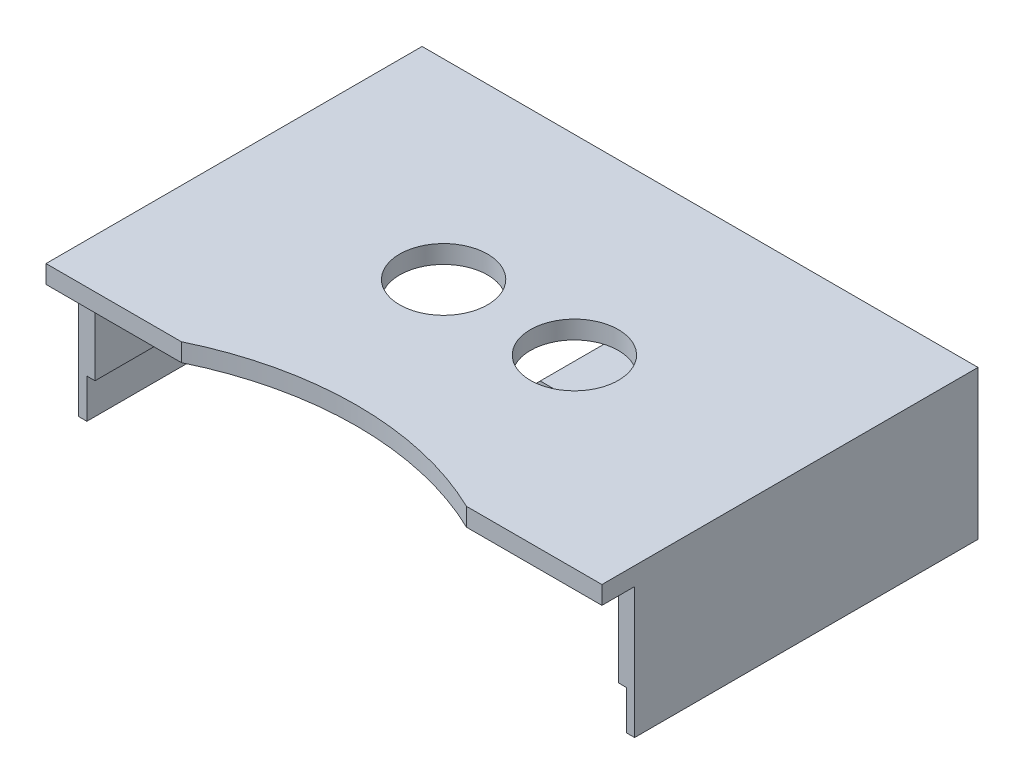
ISO-10303-21;
HEADER;
FILE_DESCRIPTION(('STEP AP214'),'2;1');
FILE_NAME('part.step','',(''),(''),'','','');
FILE_SCHEMA(('AUTOMOTIVE_DESIGN { 1 0 10303 214 1 1 1 1 }'));
ENDSEC;
DATA;
#1=APPLICATION_CONTEXT('core data for automotive mechanical design processes');
#2=APPLICATION_PROTOCOL_DEFINITION('international standard','automotive_design',2000,#1);
#3=PRODUCT_CONTEXT('',#1,'mechanical');
#4=PRODUCT('Part','Part','',(#3));
#5=PRODUCT_RELATED_PRODUCT_CATEGORY('part','',(#4));
#6=PRODUCT_DEFINITION_FORMATION('','',#4);
#7=PRODUCT_DEFINITION_CONTEXT('part definition',#1,'design');
#8=PRODUCT_DEFINITION('design','',#6,#7);
#9=PRODUCT_DEFINITION_SHAPE('','',#8);
#10=(LENGTH_UNIT() NAMED_UNIT(*) SI_UNIT(.MILLI.,.METRE.));
#11=(NAMED_UNIT(*) PLANE_ANGLE_UNIT() SI_UNIT($,.RADIAN.));
#12=(NAMED_UNIT(*) SI_UNIT($,.STERADIAN.) SOLID_ANGLE_UNIT());
#13=UNCERTAINTY_MEASURE_WITH_UNIT(LENGTH_MEASURE(1.E-05),#10,'distance_accuracy_value','');
#14=(GEOMETRIC_REPRESENTATION_CONTEXT(3) GLOBAL_UNCERTAINTY_ASSIGNED_CONTEXT((#13)) GLOBAL_UNIT_ASSIGNED_CONTEXT((#10,
#11,#12)) REPRESENTATION_CONTEXT('',''));
#15=CARTESIAN_POINT('',(0.,0.,0.));
#16=DIRECTION('',(0.,0.,1.));
#17=DIRECTION('',(1.,0.,0.));
#18=AXIS2_PLACEMENT_3D('',#15,#16,#17);
#19=CARTESIAN_POINT('',(0.,0.,69.85));
#20=DIRECTION('',(0.,0.,-1.));
#21=DIRECTION('',(-1.,0.,0.));
#22=AXIS2_PLACEMENT_3D('',#19,#20,#21);
#23=PLANE('',#22);
#24=DIRECTION('',(-1.,0.,0.));
#25=VECTOR('',#24,1.);
#26=CARTESIAN_POINT('',(-53.975,19.05,69.85));
#27=LINE('',#26,#25);
#28=CARTESIAN_POINT('',(-27.6790082914833,19.05,69.85));
#29=VERTEX_POINT('',#28);
#30=CARTESIAN_POINT('',(-53.975,19.05,69.85));
#31=VERTEX_POINT('',#30);
#32=EDGE_CURVE('E288',#29,#31,#27,.T.);
#33=ORIENTED_EDGE('',*,*,#32,.F.);
#34=DIRECTION('',(0.,1.,0.));
#35=VECTOR('',#34,1.);
#36=CARTESIAN_POINT('',(-27.6790082914832,-3.17500000000001,69.85));
#37=LINE('',#36,#35);
#38=CARTESIAN_POINT('',(-27.6790082914833,22.5637760025563,69.85));
#39=VERTEX_POINT('',#38);
#40=EDGE_CURVE('E11',#29,#39,#37,.T.);
#41=ORIENTED_EDGE('',*,*,#40,.T.);
#42=DIRECTION('',(1.,0.,0.));
#43=VECTOR('',#42,1.);
#44=CARTESIAN_POINT('',(53.975,22.5637760025563,69.85));
#45=LINE('',#44,#43);
#46=CARTESIAN_POINT('',(-53.975,22.5637760025563,69.85));
#47=VERTEX_POINT('',#46);
#48=EDGE_CURVE('E281',#47,#39,#45,.T.);
#49=ORIENTED_EDGE('',*,*,#48,.F.);
#50=DIRECTION('',(0.,1.,0.));
#51=VECTOR('',#50,1.);
#52=CARTESIAN_POINT('',(-53.975,19.05,69.85));
#53=LINE('',#52,#51);
#54=EDGE_CURVE('E292',#31,#47,#53,.T.);
#55=ORIENTED_EDGE('',*,*,#54,.F.);
#56=EDGE_LOOP('',(#33,#41,#49,#55));
#57=FACE_BOUND('',#56,.T.);
#58=ADVANCED_FACE('F33',(#57),#23,.F.);
#59=CARTESIAN_POINT('',(-8.80657951031443,0.,19.05));
#60=DIRECTION('',(0.707106781186544,-0.707106781186551,0.));
#61=DIRECTION('',(0.707106781186551,0.707106781186544,0.));
#62=AXIS2_PLACEMENT_3D('',#59,#60,#61);
#63=PLANE('',#62);
#64=DIRECTION('',(-0.707106781186551,-0.707106781186544,0.));
#65=VECTOR('',#64,1.);
#66=CARTESIAN_POINT('',(-8.80657951031443,0.,0.));
#67=LINE('',#66,#65);
#68=CARTESIAN_POINT('',(-8.80657951031443,0.,0.));
#69=VERTEX_POINT('',#68);
#70=CARTESIAN_POINT('',(-11.1143692654717,-2.30778975515724,0.));
#71=VERTEX_POINT('',#70);
#72=EDGE_CURVE('E330',#69,#71,#67,.T.);
#73=ORIENTED_EDGE('',*,*,#72,.T.);
#74=DIRECTION('',(0.,0.,-1.));
#75=VECTOR('',#74,1.);
#76=CARTESIAN_POINT('',(-11.1143692654717,-2.30778975515724,19.05));
#77=LINE('',#76,#75);
#78=CARTESIAN_POINT('',(-11.1143692654717,-2.30778975515724,19.05));
#79=VERTEX_POINT('',#78);
#80=EDGE_CURVE('E369',#71,#79,#77,.F.);
#81=ORIENTED_EDGE('',*,*,#80,.T.);
#82=DIRECTION('',(-0.707106781186551,-0.707106781186544,0.));
#83=VECTOR('',#82,1.);
#84=CARTESIAN_POINT('',(-8.80657951031443,0.,19.05));
#85=LINE('',#84,#83);
#86=CARTESIAN_POINT('',(-8.80657951031443,0.,19.05));
#87=VERTEX_POINT('',#86);
#88=EDGE_CURVE('E331',#87,#79,#85,.T.);
#89=ORIENTED_EDGE('',*,*,#88,.F.);
#90=DIRECTION('',(0.,0.,-1.));
#91=VECTOR('',#90,1.);
#92=CARTESIAN_POINT('',(-8.80657951031443,0.,19.05));
#93=LINE('',#92,#91);
#94=EDGE_CURVE('E342',#87,#69,#93,.T.);
#95=ORIENTED_EDGE('',*,*,#94,.T.);
#96=EDGE_LOOP('',(#73,#81,#89,#95));
#97=FACE_BOUND('',#96,.T.);
#98=ADVANCED_FACE('F483',(#97),#63,.F.);
#99=CARTESIAN_POINT('',(-11.9815795103145,-3.175,19.05));
#100=DIRECTION('',(0.,1.,0.));
#101=DIRECTION('',(-1.,0.,0.));
#102=AXIS2_PLACEMENT_3D('',#99,#100,#101);
#103=PLANE('',#102);
#104=DIRECTION('',(1.,0.,0.));
#105=VECTOR('',#104,1.);
#106=CARTESIAN_POINT('',(-11.9815795103145,-3.175,19.05));
#107=LINE('',#106,#105);
#108=CARTESIAN_POINT('',(-10.7551590206289,-3.175,19.05));
#109=VERTEX_POINT('',#108);
#110=CARTESIAN_POINT('',(10.7551590206289,-3.175,19.05));
#111=VERTEX_POINT('',#110);
#112=EDGE_CURVE('E334',#109,#111,#107,.T.);
#113=ORIENTED_EDGE('',*,*,#112,.F.);
#114=DIRECTION('',(0.,0.,-1.));
#115=VECTOR('',#114,1.);
#116=CARTESIAN_POINT('',(-10.7551590206289,-3.175,19.05));
#117=LINE('',#116,#115);
#118=CARTESIAN_POINT('',(-10.7551590206289,-3.175,0.));
#119=VERTEX_POINT('',#118);
#120=EDGE_CURVE('E360',#109,#119,#117,.T.);
#121=ORIENTED_EDGE('',*,*,#120,.T.);
#122=DIRECTION('',(1.,0.,0.));
#123=VECTOR('',#122,1.);
#124=CARTESIAN_POINT('',(-11.9815795103145,-3.175,0.));
#125=LINE('',#124,#123);
#126=CARTESIAN_POINT('',(10.7551590206289,-3.175,0.));
#127=VERTEX_POINT('',#126);
#128=EDGE_CURVE('E344',#119,#127,#125,.T.);
#129=ORIENTED_EDGE('',*,*,#128,.T.);
#130=DIRECTION('',(0.,0.,-1.));
#131=VECTOR('',#130,1.);
#132=CARTESIAN_POINT('',(10.7551590206289,-3.175,19.05));
#133=LINE('',#132,#131);
#134=EDGE_CURVE('E358',#127,#111,#133,.F.);
#135=ORIENTED_EDGE('',*,*,#134,.T.);
#136=EDGE_LOOP('',(#113,#121,#129,#135));
#137=FACE_BOUND('',#136,.T.);
#138=ADVANCED_FACE('F488',(#137),#103,.F.);
#139=CARTESIAN_POINT('',(8.80657951031444,0.,19.05));
#140=DIRECTION('',(-0.707106781186549,-0.707106781186546,0.));
#141=DIRECTION('',(0.707106781186546,-0.707106781186549,0.));
#142=AXIS2_PLACEMENT_3D('',#139,#140,#141);
#143=PLANE('',#142);
#144=DIRECTION('',(-0.707106781186546,0.707106781186549,0.));
#145=VECTOR('',#144,1.);
#146=CARTESIAN_POINT('',(8.80657951031444,0.,19.05));
#147=LINE('',#146,#145);
#148=CARTESIAN_POINT('',(11.1143692654717,-2.30778975515723,19.05));
#149=VERTEX_POINT('',#148);
#150=CARTESIAN_POINT('',(8.80657951031444,0.,19.05));
#151=VERTEX_POINT('',#150);
#152=EDGE_CURVE('E338',#149,#151,#147,.T.);
#153=ORIENTED_EDGE('',*,*,#152,.F.);
#154=DIRECTION('',(0.,0.,-1.));
#155=VECTOR('',#154,1.);
#156=CARTESIAN_POINT('',(11.1143692654717,-2.30778975515723,19.05));
#157=LINE('',#156,#155);
#158=CARTESIAN_POINT('',(11.1143692654717,-2.30778975515723,0.));
#159=VERTEX_POINT('',#158);
#160=EDGE_CURVE('E375',#149,#159,#157,.T.);
#161=ORIENTED_EDGE('',*,*,#160,.T.);
#162=DIRECTION('',(-0.707106781186546,0.707106781186549,0.));
#163=VECTOR('',#162,1.);
#164=CARTESIAN_POINT('',(8.80657951031444,0.,0.));
#165=LINE('',#164,#163);
#166=CARTESIAN_POINT('',(8.80657951031444,0.,0.));
#167=VERTEX_POINT('',#166);
#168=EDGE_CURVE('E346',#159,#167,#165,.T.);
#169=ORIENTED_EDGE('',*,*,#168,.T.);
#170=DIRECTION('',(0.,0.,-1.));
#171=VECTOR('',#170,1.);
#172=CARTESIAN_POINT('',(8.80657951031444,0.,19.05));
#173=LINE('',#172,#171);
#174=EDGE_CURVE('E352',#151,#167,#173,.T.);
#175=ORIENTED_EDGE('',*,*,#174,.F.);
#176=EDGE_LOOP('',(#153,#161,#169,#175));
#177=FACE_BOUND('',#176,.T.);
#178=ADVANCED_FACE('F527',(#177),#143,.F.);
#179=CARTESIAN_POINT('',(8.80657951031444,0.,19.05));
#180=DIRECTION('',(0.,-1.,0.));
#181=DIRECTION('',(1.,0.,0.));
#182=AXIS2_PLACEMENT_3D('',#179,#180,#181);
#183=PLANE('',#182);
#184=DIRECTION('',(1.,0.,0.));
#185=VECTOR('',#184,1.);
#186=CARTESIAN_POINT('',(8.80657951031444,0.,3.175));
#187=LINE('',#186,#185);
#188=CARTESIAN_POINT('',(-8.50899999999997,0.,3.175));
#189=VERTEX_POINT('',#188);
#190=CARTESIAN_POINT('',(8.50899999999997,0.,3.175));
#191=VERTEX_POINT('',#190);
#192=EDGE_CURVE('E355',#189,#191,#187,.T.);
#193=ORIENTED_EDGE('',*,*,#192,.F.);
#194=DIRECTION('',(0.,0.,-1.));
#195=VECTOR('',#194,1.);
#196=CARTESIAN_POINT('',(-8.50899999999997,0.,19.05));
#197=LINE('',#196,#195);
#198=CARTESIAN_POINT('',(-8.50899999999997,0.,0.));
#199=VERTEX_POINT('',#198);
#200=EDGE_CURVE('E328',#189,#199,#197,.T.);
#201=ORIENTED_EDGE('',*,*,#200,.T.);
#202=DIRECTION('',(-1.,0.,0.));
#203=VECTOR('',#202,1.);
#204=CARTESIAN_POINT('',(8.80657951031444,0.,0.));
#205=LINE('',#204,#203);
#206=EDGE_CURVE('E348',#199,#69,#205,.T.);
#207=ORIENTED_EDGE('',*,*,#206,.T.);
#208=ORIENTED_EDGE('',*,*,#94,.F.);
#209=DIRECTION('',(-1.,0.,0.));
#210=VECTOR('',#209,1.);
#211=CARTESIAN_POINT('',(8.80657951031444,0.,19.05));
#212=LINE('',#211,#210);
#213=EDGE_CURVE('E340',#151,#87,#212,.T.);
#214=ORIENTED_EDGE('',*,*,#213,.F.);
#215=ORIENTED_EDGE('',*,*,#174,.T.);
#216=CARTESIAN_POINT('',(8.50899999999997,0.,0.));
#217=VERTEX_POINT('',#216);
#218=EDGE_CURVE('E335',#167,#217,#205,.T.);
#219=ORIENTED_EDGE('',*,*,#218,.T.);
#220=DIRECTION('',(0.,0.,1.));
#221=VECTOR('',#220,1.);
#222=CARTESIAN_POINT('',(8.50899999999997,0.,19.05));
#223=LINE('',#222,#221);
#224=EDGE_CURVE('E325',#217,#191,#223,.T.);
#225=ORIENTED_EDGE('',*,*,#224,.T.);
#226=EDGE_LOOP('',(#193,#201,#207,#208,#214,#215,#219,#225));
#227=FACE_BOUND('',#226,.T.);
#228=ADVANCED_FACE('F523',(#227),#183,.F.);
#229=CARTESIAN_POINT('',(0.,0.,19.05));
#230=DIRECTION('',(0.,0.,1.));
#231=DIRECTION('',(1.,0.,0.));
#232=AXIS2_PLACEMENT_3D('',#229,#230,#231);
#233=PLANE('',#232);
#234=ORIENTED_EDGE('',*,*,#88,.T.);
#235=CARTESIAN_POINT('',(-10.7551590206289,-2.667,19.05));
#236=DIRECTION('',(0.,0.,1.));
#237=DIRECTION('',(1.,0.,0.));
#238=AXIS2_PLACEMENT_3D('',#235,#236,#237);
#239=CIRCLE('',#238,0.508);
#240=EDGE_CURVE('E373',#79,#109,#239,.T.);
#241=ORIENTED_EDGE('',*,*,#240,.T.);
#242=ORIENTED_EDGE('',*,*,#112,.T.);
#243=CARTESIAN_POINT('',(10.7551590206289,-2.667,19.05));
#244=DIRECTION('',(0.,0.,1.));
#245=DIRECTION('',(1.,0.,0.));
#246=AXIS2_PLACEMENT_3D('',#243,#244,#245);
#247=CIRCLE('',#246,0.508);
#248=EDGE_CURVE('E371',#111,#149,#247,.T.);
#249=ORIENTED_EDGE('',*,*,#248,.T.);
#250=ORIENTED_EDGE('',*,*,#152,.T.);
#251=ORIENTED_EDGE('',*,*,#213,.T.);
#252=EDGE_LOOP('',(#234,#241,#242,#249,#250,#251));
#253=FACE_BOUND('',#252,.T.);
#254=ADVANCED_FACE('F512',(#253),#233,.T.);
#255=CARTESIAN_POINT('',(0.,0.,3.175));
#256=DIRECTION('',(0.,0.,-1.));
#257=DIRECTION('',(-1.,0.,0.));
#258=AXIS2_PLACEMENT_3D('',#255,#256,#257);
#259=PLANE('',#258);
#260=DIRECTION('',(0.,1.,0.));
#261=VECTOR('',#260,1.);
#262=CARTESIAN_POINT('',(-8.50899999999997,-3.175,3.175));
#263=LINE('',#262,#261);
#264=CARTESIAN_POINT('',(-8.50899999999997,19.05,3.175));
#265=VERTEX_POINT('',#264);
#266=EDGE_CURVE('E308',#189,#265,#263,.T.);
#267=ORIENTED_EDGE('',*,*,#266,.F.);
#268=ORIENTED_EDGE('',*,*,#192,.T.);
#269=DIRECTION('',(0.,-1.,0.));
#270=VECTOR('',#269,1.);
#271=CARTESIAN_POINT('',(8.50899999999997,-3.175,3.175));
#272=LINE('',#271,#270);
#273=CARTESIAN_POINT('',(8.50899999999997,19.05,3.175));
#274=VERTEX_POINT('',#273);
#275=EDGE_CURVE('E314',#274,#191,#272,.T.);
#276=ORIENTED_EDGE('',*,*,#275,.F.);
#277=DIRECTION('',(1.,0.,0.));
#278=VECTOR('',#277,1.);
#279=CARTESIAN_POINT('',(-8.50899999999997,19.05,3.175));
#280=LINE('',#279,#278);
#281=EDGE_CURVE('E310',#265,#274,#280,.T.);
#282=ORIENTED_EDGE('',*,*,#281,.F.);
#283=EDGE_LOOP('',(#267,#268,#276,#282));
#284=FACE_BOUND('',#283,.T.);
#285=ADVANCED_FACE('F508',(#284),#259,.F.);
#286=CARTESIAN_POINT('',(-8.50899999999997,-3.175,3.175));
#287=DIRECTION('',(-1.,0.,0.));
#288=DIRECTION('',(0.,0.,1.));
#289=AXIS2_PLACEMENT_3D('',#286,#287,#288);
#290=PLANE('',#289);
#291=ORIENTED_EDGE('',*,*,#200,.F.);
#292=ORIENTED_EDGE('',*,*,#266,.T.);
#293=DIRECTION('',(0.,0.,-1.));
#294=VECTOR('',#293,1.);
#295=CARTESIAN_POINT('',(-8.50899999999997,19.05,3.175));
#296=LINE('',#295,#294);
#297=CARTESIAN_POINT('',(-8.50899999999997,19.05,0.));
#298=VERTEX_POINT('',#297);
#299=EDGE_CURVE('E317',#265,#298,#296,.T.);
#300=ORIENTED_EDGE('',*,*,#299,.T.);
#301=DIRECTION('',(0.,1.,0.));
#302=VECTOR('',#301,1.);
#303=CARTESIAN_POINT('',(-8.50899999999997,-3.175,0.));
#304=LINE('',#303,#302);
#305=EDGE_CURVE('E300',#199,#298,#304,.T.);
#306=ORIENTED_EDGE('',*,*,#305,.F.);
#307=EDGE_LOOP('',(#291,#292,#300,#306));
#308=FACE_BOUND('',#307,.T.);
#309=ADVANCED_FACE('F511',(#308),#290,.T.);
#310=CARTESIAN_POINT('',(8.50899999999997,-3.175,3.175));
#311=DIRECTION('',(1.,0.,0.));
#312=DIRECTION('',(0.,0.,-1.));
#313=AXIS2_PLACEMENT_3D('',#310,#311,#312);
#314=PLANE('',#313);
#315=ORIENTED_EDGE('',*,*,#224,.F.);
#316=DIRECTION('',(0.,-1.,0.));
#317=VECTOR('',#316,1.);
#318=CARTESIAN_POINT('',(8.50899999999997,-3.175,0.));
#319=LINE('',#318,#317);
#320=CARTESIAN_POINT('',(8.50899999999997,19.05,0.));
#321=VERTEX_POINT('',#320);
#322=EDGE_CURVE('E311',#321,#217,#319,.T.);
#323=ORIENTED_EDGE('',*,*,#322,.F.);
#324=DIRECTION('',(0.,0.,-1.));
#325=VECTOR('',#324,1.);
#326=CARTESIAN_POINT('',(8.50899999999997,19.05,3.175));
#327=LINE('',#326,#325);
#328=EDGE_CURVE('E322',#274,#321,#327,.T.);
#329=ORIENTED_EDGE('',*,*,#328,.F.);
#330=ORIENTED_EDGE('',*,*,#275,.T.);
#331=EDGE_LOOP('',(#315,#323,#329,#330));
#332=FACE_BOUND('',#331,.T.);
#333=ADVANCED_FACE('F514',(#332),#314,.T.);
#334=CARTESIAN_POINT('',(-53.975,19.05,69.85));
#335=DIRECTION('',(0.,-1.,0.));
#336=DIRECTION('',(1.,0.,0.));
#337=AXIS2_PLACEMENT_3D('',#334,#335,#336);
#338=PLANE('',#337);
#339=DIRECTION('',(0.,0.,-1.));
#340=VECTOR('',#339,1.);
#341=CARTESIAN_POINT('',(50.8000000000017,19.05,69.85));
#342=LINE('',#341,#340);
#343=CARTESIAN_POINT('',(50.8000000000017,19.05,63.5));
#344=VERTEX_POINT('',#343);
#345=CARTESIAN_POINT('',(50.8000000000017,19.05,0.));
#346=VERTEX_POINT('',#345);
#347=EDGE_CURVE('E245',#344,#346,#342,.T.);
#348=ORIENTED_EDGE('',*,*,#347,.F.);
#349=DIRECTION('',(-1.,0.,0.));
#350=VECTOR('',#349,1.);
#351=CARTESIAN_POINT('',(-53.975,19.05,63.5));
#352=LINE('',#351,#350);
#353=CARTESIAN_POINT('',(53.975,19.05,63.5));
#354=VERTEX_POINT('',#353);
#355=EDGE_CURVE('E242',#354,#344,#352,.T.);
#356=ORIENTED_EDGE('',*,*,#355,.F.);
#357=DIRECTION('',(0.,0.,-1.));
#358=VECTOR('',#357,1.);
#359=CARTESIAN_POINT('',(53.975,19.05,69.85));
#360=LINE('',#359,#358);
#361=CARTESIAN_POINT('',(53.975,19.05,69.85));
#362=VERTEX_POINT('',#361);
#363=EDGE_CURVE('E304',#362,#354,#360,.T.);
#364=ORIENTED_EDGE('',*,*,#363,.F.);
#365=CARTESIAN_POINT('',(27.6790082914833,19.05,69.85));
#366=VERTEX_POINT('',#365);
#367=EDGE_CURVE('E289',#362,#366,#27,.T.);
#368=ORIENTED_EDGE('',*,*,#367,.T.);
#369=CARTESIAN_POINT('',(0.,19.05,127.));
#370=DIRECTION('',(0.,-1.,0.));
#371=DIRECTION('',(1.,0.,0.));
#372=AXIS2_PLACEMENT_3D('',#369,#370,#371);
#373=CIRCLE('',#372,63.5);
#374=EDGE_CURVE('E266',#29,#366,#373,.T.);
#375=ORIENTED_EDGE('',*,*,#374,.F.);
#376=ORIENTED_EDGE('',*,*,#32,.T.);
#377=DIRECTION('',(0.,0.,-1.));
#378=VECTOR('',#377,1.);
#379=CARTESIAN_POINT('',(-53.975,19.05,69.85));
#380=LINE('',#379,#378);
#381=CARTESIAN_POINT('',(-53.975,19.05,63.5));
#382=VERTEX_POINT('',#381);
#383=EDGE_CURVE('E301',#31,#382,#380,.T.);
#384=ORIENTED_EDGE('',*,*,#383,.T.);
#385=DIRECTION('',(-1.,0.,0.));
#386=VECTOR('',#385,1.);
#387=CARTESIAN_POINT('',(-53.975,19.05,63.5));
#388=LINE('',#387,#386);
#389=CARTESIAN_POINT('',(-50.8000000000017,19.05,63.5));
#390=VERTEX_POINT('',#389);
#391=EDGE_CURVE('E260',#390,#382,#388,.T.);
#392=ORIENTED_EDGE('',*,*,#391,.F.);
#393=DIRECTION('',(0.,0.,1.));
#394=VECTOR('',#393,1.);
#395=CARTESIAN_POINT('',(-50.8000000000017,19.05,69.85));
#396=LINE('',#395,#394);
#397=CARTESIAN_POINT('',(-50.8000000000017,19.05,0.));
#398=VERTEX_POINT('',#397);
#399=EDGE_CURVE('E262',#398,#390,#396,.T.);
#400=ORIENTED_EDGE('',*,*,#399,.F.);
#401=DIRECTION('',(-1.,0.,0.));
#402=VECTOR('',#401,1.);
#403=CARTESIAN_POINT('',(-53.975,19.05,0.));
#404=LINE('',#403,#402);
#405=EDGE_CURVE('E280',#298,#398,#404,.T.);
#406=ORIENTED_EDGE('',*,*,#405,.F.);
#407=ORIENTED_EDGE('',*,*,#299,.F.);
#408=ORIENTED_EDGE('',*,*,#281,.T.);
#409=ORIENTED_EDGE('',*,*,#328,.T.);
#410=EDGE_CURVE('E296',#346,#321,#404,.T.);
#411=ORIENTED_EDGE('',*,*,#410,.F.);
#412=EDGE_LOOP('',(#348,#356,#364,#368,#375,#376,#384,#392,#400,#406,#407,#408,#409,#411));
#413=FACE_BOUND('',#412,.T.);
#414=CARTESIAN_POINT('',(12.7,19.05,33.9190627998391));
#415=DIRECTION('',(0.,-1.,0.));
#416=DIRECTION('',(1.,0.,0.));
#417=AXIS2_PLACEMENT_3D('',#414,#415,#416);
#418=CIRCLE('',#417,8.54075);
#419=CARTESIAN_POINT('',(21.24075,19.05,33.9190627998391));
#420=VERTEX_POINT('',#419);
#421=EDGE_CURVE('E277',#420,#420,#418,.T.);
#422=ORIENTED_EDGE('',*,*,#421,.F.);
#423=EDGE_LOOP('',(#422));
#424=FACE_BOUND('',#423,.T.);
#425=CARTESIAN_POINT('',(-12.7,19.05,33.9190627998391));
#426=DIRECTION('',(0.,-1.,0.));
#427=DIRECTION('',(1.,0.,0.));
#428=AXIS2_PLACEMENT_3D('',#425,#426,#427);
#429=CIRCLE('',#428,8.54075);
#430=CARTESIAN_POINT('',(-4.15925,19.05,33.9190627998391));
#431=VERTEX_POINT('',#430);
#432=EDGE_CURVE('E272',#431,#431,#429,.T.);
#433=ORIENTED_EDGE('',*,*,#432,.F.);
#434=EDGE_LOOP('',(#433));
#435=FACE_BOUND('',#434,.T.);
#436=ADVANCED_FACE('F388',(#413,#424,#435),#338,.T.);
#437=CARTESIAN_POINT('',(53.975,22.5637760025563,69.85));
#438=DIRECTION('',(0.,1.,0.));
#439=DIRECTION('',(-1.,0.,0.));
#440=AXIS2_PLACEMENT_3D('',#437,#438,#439);
#441=PLANE('',#440);
#442=DIRECTION('',(0.,0.,-1.));
#443=VECTOR('',#442,1.);
#444=CARTESIAN_POINT('',(53.975,22.5637760025563,69.85));
#445=LINE('',#444,#443);
#446=CARTESIAN_POINT('',(53.975,22.5637760025563,69.85));
#447=VERTEX_POINT('',#446);
#448=CARTESIAN_POINT('',(53.975,22.5637760025563,-3.175));
#449=VERTEX_POINT('',#448);
#450=EDGE_CURVE('E295',#447,#449,#445,.T.);
#451=ORIENTED_EDGE('',*,*,#450,.T.);
#452=DIRECTION('',(1.,0.,0.));
#453=VECTOR('',#452,1.);
#454=CARTESIAN_POINT('',(-53.975,22.5637760025563,-3.175));
#455=LINE('',#454,#453);
#456=CARTESIAN_POINT('',(-53.975,22.5637760025563,-3.175));
#457=VERTEX_POINT('',#456);
#458=EDGE_CURVE('E403',#457,#449,#455,.T.);
#459=ORIENTED_EDGE('',*,*,#458,.F.);
#460=DIRECTION('',(0.,0.,-1.));
#461=VECTOR('',#460,1.);
#462=CARTESIAN_POINT('',(-53.975,22.5637760025563,69.85));
#463=LINE('',#462,#461);
#464=EDGE_CURVE('E298',#47,#457,#463,.T.);
#465=ORIENTED_EDGE('',*,*,#464,.F.);
#466=ORIENTED_EDGE('',*,*,#48,.T.);
#467=CARTESIAN_POINT('',(0.,22.5637760025563,127.));
#468=DIRECTION('',(0.,1.,0.));
#469=DIRECTION('',(-1.,0.,0.));
#470=AXIS2_PLACEMENT_3D('',#467,#468,#469);
#471=CIRCLE('',#470,63.5);
#472=CARTESIAN_POINT('',(27.6790082914833,22.5637760025563,69.85));
#473=VERTEX_POINT('',#472);
#474=EDGE_CURVE('E264',#473,#39,#471,.T.);
#475=ORIENTED_EDGE('',*,*,#474,.F.);
#476=EDGE_CURVE('E285',#473,#447,#45,.T.);
#477=ORIENTED_EDGE('',*,*,#476,.T.);
#478=EDGE_LOOP('',(#451,#459,#465,#466,#475,#477));
#479=FACE_BOUND('',#478,.T.);
#480=CARTESIAN_POINT('',(12.7,22.5637760025563,33.9190627998391));
#481=DIRECTION('',(0.,1.,0.));
#482=DIRECTION('',(-1.,0.,0.));
#483=AXIS2_PLACEMENT_3D('',#480,#481,#482);
#484=CIRCLE('',#483,8.54075);
#485=CARTESIAN_POINT('',(4.15925,22.5637760025563,33.9190627998391));
#486=VERTEX_POINT('',#485);
#487=EDGE_CURVE('E269',#486,#486,#484,.T.);
#488=ORIENTED_EDGE('',*,*,#487,.F.);
#489=EDGE_LOOP('',(#488));
#490=FACE_BOUND('',#489,.T.);
#491=CARTESIAN_POINT('',(-12.7,22.5637760025563,33.9190627998391));
#492=DIRECTION('',(0.,1.,0.));
#493=DIRECTION('',(-1.,0.,0.));
#494=AXIS2_PLACEMENT_3D('',#491,#492,#493);
#495=CIRCLE('',#494,8.54075);
#496=CARTESIAN_POINT('',(-21.24075,22.5637760025563,33.9190627998391));
#497=VERTEX_POINT('',#496);
#498=EDGE_CURVE('E268',#497,#497,#495,.T.);
#499=ORIENTED_EDGE('',*,*,#498,.F.);
#500=EDGE_LOOP('',(#499));
#501=FACE_BOUND('',#500,.T.);
#502=ADVANCED_FACE('F401',(#479,#490,#501),#441,.T.);
#503=CARTESIAN_POINT('',(-53.975,19.05,69.85));
#504=DIRECTION('',(-1.,0.,0.));
#505=DIRECTION('',(0.,0.,1.));
#506=AXIS2_PLACEMENT_3D('',#503,#504,#505);
#507=PLANE('',#506);
#508=ORIENTED_EDGE('',*,*,#464,.T.);
#509=DIRECTION('',(0.,1.,0.));
#510=VECTOR('',#509,1.);
#511=CARTESIAN_POINT('',(-53.975,22.5637760025563,-3.175));
#512=LINE('',#511,#510);
#513=CARTESIAN_POINT('',(-53.975,-6.34999999999829,-3.175));
#514=VERTEX_POINT('',#513);
#515=EDGE_CURVE('E409',#514,#457,#512,.T.);
#516=ORIENTED_EDGE('',*,*,#515,.F.);
#517=DIRECTION('',(0.,0.,-1.));
#518=VECTOR('',#517,1.);
#519=CARTESIAN_POINT('',(-53.975,-6.3499999999983,63.5));
#520=LINE('',#519,#518);
#521=CARTESIAN_POINT('',(-53.975,-6.3499999999983,63.5));
#522=VERTEX_POINT('',#521);
#523=EDGE_CURVE('E256',#522,#514,#520,.T.);
#524=ORIENTED_EDGE('',*,*,#523,.F.);
#525=DIRECTION('',(0.,1.,0.));
#526=VECTOR('',#525,1.);
#527=CARTESIAN_POINT('',(-53.975,22.5637760025563,63.5));
#528=LINE('',#527,#526);
#529=EDGE_CURVE('E248',#522,#382,#528,.T.);
#530=ORIENTED_EDGE('',*,*,#529,.T.);
#531=ORIENTED_EDGE('',*,*,#383,.F.);
#532=ORIENTED_EDGE('',*,*,#54,.T.);
#533=EDGE_LOOP('',(#508,#516,#524,#530,#531,#532));
#534=FACE_BOUND('',#533,.T.);
#535=ADVANCED_FACE('F464',(#534),#507,.T.);
#536=CARTESIAN_POINT('',(53.975,19.05,69.85));
#537=DIRECTION('',(1.,0.,0.));
#538=DIRECTION('',(0.,0.,-1.));
#539=AXIS2_PLACEMENT_3D('',#536,#537,#538);
#540=PLANE('',#539);
#541=ORIENTED_EDGE('',*,*,#363,.T.);
#542=DIRECTION('',(0.,-1.,0.));
#543=VECTOR('',#542,1.);
#544=CARTESIAN_POINT('',(53.975,22.5637760025563,63.5));
#545=LINE('',#544,#543);
#546=CARTESIAN_POINT('',(53.975,-6.3499999999983,63.5));
#547=VERTEX_POINT('',#546);
#548=EDGE_CURVE('E233',#354,#547,#545,.T.);
#549=ORIENTED_EDGE('',*,*,#548,.T.);
#550=DIRECTION('',(0.,0.,-1.));
#551=VECTOR('',#550,1.);
#552=CARTESIAN_POINT('',(53.975,-6.3499999999983,63.5));
#553=LINE('',#552,#551);
#554=CARTESIAN_POINT('',(53.975,-6.3499999999983,-3.175));
#555=VERTEX_POINT('',#554);
#556=EDGE_CURVE('E231',#547,#555,#553,.T.);
#557=ORIENTED_EDGE('',*,*,#556,.T.);
#558=DIRECTION('',(0.,-1.,0.));
#559=VECTOR('',#558,1.);
#560=CARTESIAN_POINT('',(53.975,22.5637760025563,-3.175));
#561=LINE('',#560,#559);
#562=EDGE_CURVE('E397',#449,#555,#561,.T.);
#563=ORIENTED_EDGE('',*,*,#562,.F.);
#564=ORIENTED_EDGE('',*,*,#450,.F.);
#565=DIRECTION('',(0.,-1.,0.));
#566=VECTOR('',#565,1.);
#567=CARTESIAN_POINT('',(53.975,19.05,69.85));
#568=LINE('',#567,#566);
#569=EDGE_CURVE('E284',#447,#362,#568,.T.);
#570=ORIENTED_EDGE('',*,*,#569,.T.);
#571=EDGE_LOOP('',(#541,#549,#557,#563,#564,#570));
#572=FACE_BOUND('',#571,.T.);
#573=ADVANCED_FACE('F393',(#572),#540,.T.);
#574=ORIENTED_EDGE('',*,*,#476,.F.);
#575=DIRECTION('',(0.,1.,0.));
#576=VECTOR('',#575,1.);
#577=CARTESIAN_POINT('',(27.6790082914833,-3.17500000000001,69.85));
#578=LINE('',#577,#576);
#579=EDGE_CURVE('E41',#473,#366,#578,.F.);
#580=ORIENTED_EDGE('',*,*,#579,.T.);
#581=ORIENTED_EDGE('',*,*,#367,.F.);
#582=ORIENTED_EDGE('',*,*,#569,.F.);
#583=EDGE_LOOP('',(#574,#580,#581,#582));
#584=FACE_BOUND('',#583,.T.);
#585=ADVANCED_FACE('F381',(#584),#23,.F.);
#586=CARTESIAN_POINT('',(-10.7551590206289,-2.667,19.05));
#587=DIRECTION('',(0.,0.,-1.));
#588=DIRECTION('',(-1.,0.,0.));
#589=AXIS2_PLACEMENT_3D('',#586,#587,#588);
#590=CYLINDRICAL_SURFACE('',#589,0.508);
#591=ORIENTED_EDGE('',*,*,#240,.F.);
#592=ORIENTED_EDGE('',*,*,#80,.F.);
#593=CARTESIAN_POINT('',(-10.7551590206289,-2.667,0.));
#594=DIRECTION('',(0.,0.,1.));
#595=DIRECTION('',(1.,0.,0.));
#596=AXIS2_PLACEMENT_3D('',#593,#594,#595);
#597=CIRCLE('',#596,0.508);
#598=EDGE_CURVE('E366',#119,#71,#597,.F.);
#599=ORIENTED_EDGE('',*,*,#598,.F.);
#600=ORIENTED_EDGE('',*,*,#120,.F.);
#601=EDGE_LOOP('',(#591,#592,#599,#600));
#602=FACE_BOUND('',#601,.T.);
#603=ADVANCED_FACE('F494',(#602),#590,.T.);
#604=CARTESIAN_POINT('',(10.7551590206289,-2.667,19.05));
#605=DIRECTION('',(0.,0.,-1.));
#606=DIRECTION('',(-1.,0.,0.));
#607=AXIS2_PLACEMENT_3D('',#604,#605,#606);
#608=CYLINDRICAL_SURFACE('',#607,0.508);
#609=ORIENTED_EDGE('',*,*,#248,.F.);
#610=ORIENTED_EDGE('',*,*,#134,.F.);
#611=CARTESIAN_POINT('',(10.7551590206289,-2.667,0.));
#612=DIRECTION('',(0.,0.,1.));
#613=DIRECTION('',(1.,0.,0.));
#614=AXIS2_PLACEMENT_3D('',#611,#612,#613);
#615=CIRCLE('',#614,0.508);
#616=EDGE_CURVE('E363',#159,#127,#615,.F.);
#617=ORIENTED_EDGE('',*,*,#616,.F.);
#618=ORIENTED_EDGE('',*,*,#160,.F.);
#619=EDGE_LOOP('',(#609,#610,#617,#618));
#620=FACE_BOUND('',#619,.T.);
#621=ADVANCED_FACE('F35',(#620),#608,.T.);
#622=CARTESIAN_POINT('',(-12.7,-3.175,33.9190627998391));
#623=DIRECTION('',(0.,1.,0.));
#624=DIRECTION('',(-1.,0.,0.));
#625=AXIS2_PLACEMENT_3D('',#622,#623,#624);
#626=CYLINDRICAL_SURFACE('',#625,8.54075);
#627=ORIENTED_EDGE('',*,*,#432,.T.);
#628=EDGE_LOOP('',(#627));
#629=FACE_BOUND('',#628,.T.);
#630=ORIENTED_EDGE('',*,*,#498,.T.);
#631=EDGE_LOOP('',(#630));
#632=FACE_BOUND('',#631,.T.);
#633=ADVANCED_FACE('F478',(#629,#632),#626,.F.);
#634=CARTESIAN_POINT('',(12.7,-3.175,33.9190627998391));
#635=DIRECTION('',(0.,1.,0.));
#636=DIRECTION('',(-1.,0.,0.));
#637=AXIS2_PLACEMENT_3D('',#634,#635,#636);
#638=CYLINDRICAL_SURFACE('',#637,8.54075);
#639=ORIENTED_EDGE('',*,*,#421,.T.);
#640=EDGE_LOOP('',(#639));
#641=FACE_BOUND('',#640,.T.);
#642=ORIENTED_EDGE('',*,*,#487,.T.);
#643=EDGE_LOOP('',(#642));
#644=FACE_BOUND('',#643,.T.);
#645=ADVANCED_FACE('F471',(#641,#644),#638,.F.);
#646=CARTESIAN_POINT('',(0.,-3.17500000000001,127.));
#647=DIRECTION('',(0.,1.,0.));
#648=DIRECTION('',(-1.,0.,0.));
#649=AXIS2_PLACEMENT_3D('',#646,#647,#648);
#650=CYLINDRICAL_SURFACE('',#649,63.5);
#651=ORIENTED_EDGE('',*,*,#374,.T.);
#652=ORIENTED_EDGE('',*,*,#579,.F.);
#653=ORIENTED_EDGE('',*,*,#474,.T.);
#654=ORIENTED_EDGE('',*,*,#40,.F.);
#655=EDGE_LOOP('',(#651,#652,#653,#654));
#656=FACE_BOUND('',#655,.T.);
#657=ADVANCED_FACE('F469',(#656),#650,.F.);
#658=CARTESIAN_POINT('',(-53.975,-6.3499999999983,63.5));
#659=DIRECTION('',(0.,-1.,0.));
#660=DIRECTION('',(1.,0.,0.));
#661=AXIS2_PLACEMENT_3D('',#658,#659,#660);
#662=PLANE('',#661);
#663=DIRECTION('',(0.,0.,1.));
#664=VECTOR('',#663,1.);
#665=CARTESIAN_POINT('',(52.3875000000017,-6.3499999999983,-7.78360817680335));
#666=LINE('',#665,#664);
#667=CARTESIAN_POINT('',(52.3875000000017,-6.3499999999983,0.));
#668=VERTEX_POINT('',#667);
#669=CARTESIAN_POINT('',(52.3875000000017,-6.3499999999983,63.5));
#670=VERTEX_POINT('',#669);
#671=EDGE_CURVE('E208',#668,#670,#666,.T.);
#672=ORIENTED_EDGE('',*,*,#671,.F.);
#673=DIRECTION('',(-1.,0.,0.));
#674=VECTOR('',#673,1.);
#675=CARTESIAN_POINT('',(-53.975,-6.34999999999829,0.));
#676=LINE('',#675,#674);
#677=CARTESIAN_POINT('',(-52.3875000000017,-6.3499999999983,0.));
#678=VERTEX_POINT('',#677);
#679=EDGE_CURVE('E412',#668,#678,#676,.T.);
#680=ORIENTED_EDGE('',*,*,#679,.T.);
#681=DIRECTION('',(0.,0.,1.));
#682=VECTOR('',#681,1.);
#683=CARTESIAN_POINT('',(-52.3875000000017,-6.3499999999983,-7.78360817680335));
#684=LINE('',#683,#682);
#685=CARTESIAN_POINT('',(-52.3875000000017,-6.3499999999983,63.5));
#686=VERTEX_POINT('',#685);
#687=EDGE_CURVE('E427',#678,#686,#684,.T.);
#688=ORIENTED_EDGE('',*,*,#687,.T.);
#689=DIRECTION('',(-1.,0.,0.));
#690=VECTOR('',#689,1.);
#691=CARTESIAN_POINT('',(-53.975,-6.3499999999983,63.5));
#692=LINE('',#691,#690);
#693=EDGE_CURVE('E254',#686,#522,#692,.T.);
#694=ORIENTED_EDGE('',*,*,#693,.T.);
#695=ORIENTED_EDGE('',*,*,#523,.T.);
#696=DIRECTION('',(-1.,0.,0.));
#697=VECTOR('',#696,1.);
#698=CARTESIAN_POINT('',(-53.975,-6.34999999999829,-3.175));
#699=LINE('',#698,#697);
#700=EDGE_CURVE('E240',#555,#514,#699,.T.);
#701=ORIENTED_EDGE('',*,*,#700,.F.);
#702=ORIENTED_EDGE('',*,*,#556,.F.);
#703=DIRECTION('',(-1.,0.,0.));
#704=VECTOR('',#703,1.);
#705=CARTESIAN_POINT('',(53.975,-6.3499999999983,63.5));
#706=LINE('',#705,#704);
#707=EDGE_CURVE('E224',#547,#670,#706,.T.);
#708=ORIENTED_EDGE('',*,*,#707,.T.);
#709=EDGE_LOOP('',(#672,#680,#688,#694,#695,#701,#702,#708));
#710=FACE_BOUND('',#709,.T.);
#711=ADVANCED_FACE('F229',(#710),#662,.T.);
#712=CARTESIAN_POINT('',(-50.8000000000017,22.5637760025563,63.5));
#713=DIRECTION('',(1.,0.,0.));
#714=DIRECTION('',(0.,0.,-1.));
#715=AXIS2_PLACEMENT_3D('',#712,#713,#714);
#716=PLANE('',#715);
#717=DIRECTION('',(0.,0.,1.));
#718=VECTOR('',#717,1.);
#719=CARTESIAN_POINT('',(-50.8000000000017,1.27000000000167,-7.78360817680335));
#720=LINE('',#719,#718);
#721=CARTESIAN_POINT('',(-50.8000000000017,1.27000000000167,0.));
#722=VERTEX_POINT('',#721);
#723=CARTESIAN_POINT('',(-50.8000000000017,1.27000000000167,63.5));
#724=VERTEX_POINT('',#723);
#725=EDGE_CURVE('E433',#722,#724,#720,.T.);
#726=ORIENTED_EDGE('',*,*,#725,.F.);
#727=DIRECTION('',(0.,-1.,0.));
#728=VECTOR('',#727,1.);
#729=CARTESIAN_POINT('',(-50.8000000000017,22.5637760025563,0.));
#730=LINE('',#729,#728);
#731=EDGE_CURVE('E247',#398,#722,#730,.T.);
#732=ORIENTED_EDGE('',*,*,#731,.F.);
#733=ORIENTED_EDGE('',*,*,#399,.T.);
#734=DIRECTION('',(0.,-1.,0.));
#735=VECTOR('',#734,1.);
#736=CARTESIAN_POINT('',(-50.8000000000017,22.5637760025563,63.5));
#737=LINE('',#736,#735);
#738=EDGE_CURVE('E251',#390,#724,#737,.T.);
#739=ORIENTED_EDGE('',*,*,#738,.T.);
#740=EDGE_LOOP('',(#726,#732,#733,#739));
#741=FACE_BOUND('',#740,.T.);
#742=ADVANCED_FACE('F444',(#741),#716,.T.);
#743=CARTESIAN_POINT('',(0.,0.,63.5));
#744=DIRECTION('',(0.,0.,1.));
#745=DIRECTION('',(1.,0.,0.));
#746=AXIS2_PLACEMENT_3D('',#743,#744,#745);
#747=PLANE('',#746);
#748=DIRECTION('',(0.,-1.,0.));
#749=VECTOR('',#748,1.);
#750=CARTESIAN_POINT('',(-52.3875000000017,-6.3499999999983,63.5));
#751=LINE('',#750,#749);
#752=CARTESIAN_POINT('',(-52.3875000000017,1.27000000000167,63.5));
#753=VERTEX_POINT('',#752);
#754=EDGE_CURVE('E431',#753,#686,#751,.T.);
#755=ORIENTED_EDGE('',*,*,#754,.F.);
#756=DIRECTION('',(-1.,0.,0.));
#757=VECTOR('',#756,1.);
#758=CARTESIAN_POINT('',(-50.8000000000017,1.27000000000167,63.5));
#759=LINE('',#758,#757);
#760=EDGE_CURVE('E428',#724,#753,#759,.T.);
#761=ORIENTED_EDGE('',*,*,#760,.F.);
#762=ORIENTED_EDGE('',*,*,#738,.F.);
#763=ORIENTED_EDGE('',*,*,#391,.T.);
#764=ORIENTED_EDGE('',*,*,#529,.F.);
#765=ORIENTED_EDGE('',*,*,#693,.F.);
#766=EDGE_LOOP('',(#755,#761,#762,#763,#764,#765));
#767=FACE_BOUND('',#766,.T.);
#768=ADVANCED_FACE('F456',(#767),#747,.T.);
#769=CARTESIAN_POINT('',(50.8000000000017,22.5637760025563,63.5));
#770=DIRECTION('',(-1.,0.,0.));
#771=DIRECTION('',(0.,0.,1.));
#772=AXIS2_PLACEMENT_3D('',#769,#770,#771);
#773=PLANE('',#772);
#774=DIRECTION('',(0.,0.,1.));
#775=VECTOR('',#774,1.);
#776=CARTESIAN_POINT('',(50.8000000000017,1.27000000000169,-7.78360817680335));
#777=LINE('',#776,#775);
#778=CARTESIAN_POINT('',(50.8000000000017,1.27000000000169,0.));
#779=VERTEX_POINT('',#778);
#780=CARTESIAN_POINT('',(50.8000000000017,1.27000000000169,63.5));
#781=VERTEX_POINT('',#780);
#782=EDGE_CURVE('E48',#779,#781,#777,.T.);
#783=ORIENTED_EDGE('',*,*,#782,.T.);
#784=DIRECTION('',(0.,1.,0.));
#785=VECTOR('',#784,1.);
#786=CARTESIAN_POINT('',(50.8000000000017,22.5637760025563,63.5));
#787=LINE('',#786,#785);
#788=EDGE_CURVE('E232',#781,#344,#787,.T.);
#789=ORIENTED_EDGE('',*,*,#788,.T.);
#790=ORIENTED_EDGE('',*,*,#347,.T.);
#791=DIRECTION('',(0.,1.,0.));
#792=VECTOR('',#791,1.);
#793=CARTESIAN_POINT('',(50.8000000000017,22.5637760025563,0.));
#794=LINE('',#793,#792);
#795=EDGE_CURVE('E55',#779,#346,#794,.T.);
#796=ORIENTED_EDGE('',*,*,#795,.F.);
#797=EDGE_LOOP('',(#783,#789,#790,#796));
#798=FACE_BOUND('',#797,.T.);
#799=ADVANCED_FACE('F560',(#798),#773,.T.);
#800=CARTESIAN_POINT('',(0.,0.,63.5));
#801=DIRECTION('',(0.,0.,1.));
#802=DIRECTION('',(1.,0.,0.));
#803=AXIS2_PLACEMENT_3D('',#800,#801,#802);
#804=PLANE('',#803);
#805=DIRECTION('',(-1.,0.,0.));
#806=VECTOR('',#805,1.);
#807=CARTESIAN_POINT('',(50.8000000000017,1.27000000000169,63.5));
#808=LINE('',#807,#806);
#809=CARTESIAN_POINT('',(52.3875000000017,1.2700000000017,63.5));
#810=VERTEX_POINT('',#809);
#811=EDGE_CURVE('E219',#810,#781,#808,.T.);
#812=ORIENTED_EDGE('',*,*,#811,.F.);
#813=DIRECTION('',(0.,1.,0.));
#814=VECTOR('',#813,1.);
#815=CARTESIAN_POINT('',(52.3875000000017,-6.3499999999983,63.5));
#816=LINE('',#815,#814);
#817=EDGE_CURVE('E212',#670,#810,#816,.T.);
#818=ORIENTED_EDGE('',*,*,#817,.F.);
#819=ORIENTED_EDGE('',*,*,#707,.F.);
#820=ORIENTED_EDGE('',*,*,#548,.F.);
#821=ORIENTED_EDGE('',*,*,#355,.T.);
#822=ORIENTED_EDGE('',*,*,#788,.F.);
#823=EDGE_LOOP('',(#812,#818,#819,#820,#821,#822));
#824=FACE_BOUND('',#823,.T.);
#825=ADVANCED_FACE('F223',(#824),#804,.T.);
#826=CARTESIAN_POINT('',(0.,0.,-3.175));
#827=DIRECTION('',(0.,0.,1.));
#828=DIRECTION('',(1.,0.,0.));
#829=AXIS2_PLACEMENT_3D('',#826,#827,#828);
#830=PLANE('',#829);
#831=ORIENTED_EDGE('',*,*,#515,.T.);
#832=ORIENTED_EDGE('',*,*,#458,.T.);
#833=ORIENTED_EDGE('',*,*,#562,.T.);
#834=ORIENTED_EDGE('',*,*,#700,.T.);
#835=EDGE_LOOP('',(#831,#832,#833,#834));
#836=FACE_BOUND('',#835,.T.);
#837=ADVANCED_FACE('F406',(#836),#830,.F.);
#838=CARTESIAN_POINT('',(0.,0.,0.));
#839=DIRECTION('',(0.,0.,1.));
#840=DIRECTION('',(1.,0.,0.));
#841=AXIS2_PLACEMENT_3D('',#838,#839,#840);
#842=PLANE('',#841);
#843=ORIENTED_EDGE('',*,*,#679,.F.);
#844=DIRECTION('',(0.,-1.,0.));
#845=VECTOR('',#844,1.);
#846=CARTESIAN_POINT('',(52.3875000000017,-6.3499999999983,0.));
#847=LINE('',#846,#845);
#848=CARTESIAN_POINT('',(52.3875000000017,1.2700000000017,0.));
#849=VERTEX_POINT('',#848);
#850=EDGE_CURVE('E215',#849,#668,#847,.T.);
#851=ORIENTED_EDGE('',*,*,#850,.F.);
#852=DIRECTION('',(1.,0.,0.));
#853=VECTOR('',#852,1.);
#854=CARTESIAN_POINT('',(50.8000000000017,1.27000000000169,0.));
#855=LINE('',#854,#853);
#856=EDGE_CURVE('E416',#779,#849,#855,.T.);
#857=ORIENTED_EDGE('',*,*,#856,.F.);
#858=ORIENTED_EDGE('',*,*,#795,.T.);
#859=ORIENTED_EDGE('',*,*,#410,.T.);
#860=ORIENTED_EDGE('',*,*,#322,.T.);
#861=ORIENTED_EDGE('',*,*,#218,.F.);
#862=ORIENTED_EDGE('',*,*,#168,.F.);
#863=ORIENTED_EDGE('',*,*,#616,.T.);
#864=ORIENTED_EDGE('',*,*,#128,.F.);
#865=ORIENTED_EDGE('',*,*,#598,.T.);
#866=ORIENTED_EDGE('',*,*,#72,.F.);
#867=ORIENTED_EDGE('',*,*,#206,.F.);
#868=ORIENTED_EDGE('',*,*,#305,.T.);
#869=ORIENTED_EDGE('',*,*,#405,.T.);
#870=ORIENTED_EDGE('',*,*,#731,.T.);
#871=DIRECTION('',(1.,0.,0.));
#872=VECTOR('',#871,1.);
#873=CARTESIAN_POINT('',(-50.8000000000017,1.27000000000167,0.));
#874=LINE('',#873,#872);
#875=CARTESIAN_POINT('',(-52.3875000000017,1.27000000000167,0.));
#876=VERTEX_POINT('',#875);
#877=EDGE_CURVE('E226',#876,#722,#874,.T.);
#878=ORIENTED_EDGE('',*,*,#877,.F.);
#879=DIRECTION('',(0.,1.,0.));
#880=VECTOR('',#879,1.);
#881=CARTESIAN_POINT('',(-52.3875000000017,-6.3499999999983,0.));
#882=LINE('',#881,#880);
#883=EDGE_CURVE('E425',#678,#876,#882,.T.);
#884=ORIENTED_EDGE('',*,*,#883,.F.);
#885=EDGE_LOOP('',(#843,#851,#857,#858,#859,#860,#861,#862,#863,#864,#865,#866,#867,#868,#869,
#870,#878,#884));
#886=FACE_BOUND('',#885,.T.);
#887=ADVANCED_FACE('F448',(#886),#842,.T.);
#888=CARTESIAN_POINT('',(-52.3875000000017,-6.3499999999983,-7.78360817680335));
#889=DIRECTION('',(-1.,0.,0.));
#890=DIRECTION('',(0.,0.,1.));
#891=AXIS2_PLACEMENT_3D('',#888,#889,#890);
#892=PLANE('',#891);
#893=ORIENTED_EDGE('',*,*,#883,.T.);
#894=DIRECTION('',(0.,0.,1.));
#895=VECTOR('',#894,1.);
#896=CARTESIAN_POINT('',(-52.3875000000017,1.27000000000167,-7.78360817680335));
#897=LINE('',#896,#895);
#898=EDGE_CURVE('E435',#876,#753,#897,.T.);
#899=ORIENTED_EDGE('',*,*,#898,.T.);
#900=ORIENTED_EDGE('',*,*,#754,.T.);
#901=ORIENTED_EDGE('',*,*,#687,.F.);
#902=EDGE_LOOP('',(#893,#899,#900,#901));
#903=FACE_BOUND('',#902,.T.);
#904=ADVANCED_FACE('F461',(#903),#892,.F.);
#905=CARTESIAN_POINT('',(-50.8000000000017,1.27000000000167,-7.78360817680335));
#906=DIRECTION('',(0.,1.,0.));
#907=DIRECTION('',(-1.,0.,0.));
#908=AXIS2_PLACEMENT_3D('',#905,#906,#907);
#909=PLANE('',#908);
#910=ORIENTED_EDGE('',*,*,#877,.T.);
#911=ORIENTED_EDGE('',*,*,#725,.T.);
#912=ORIENTED_EDGE('',*,*,#760,.T.);
#913=ORIENTED_EDGE('',*,*,#898,.F.);
#914=EDGE_LOOP('',(#910,#911,#912,#913));
#915=FACE_BOUND('',#914,.T.);
#916=ADVANCED_FACE('F441',(#915),#909,.F.);
#917=CARTESIAN_POINT('',(50.8000000000017,1.27000000000169,-7.78360817680335));
#918=DIRECTION('',(0.,1.,0.));
#919=DIRECTION('',(-1.,0.,0.));
#920=AXIS2_PLACEMENT_3D('',#917,#918,#919);
#921=PLANE('',#920);
#922=ORIENTED_EDGE('',*,*,#856,.T.);
#923=DIRECTION('',(0.,0.,1.));
#924=VECTOR('',#923,1.);
#925=CARTESIAN_POINT('',(52.3875000000017,1.2700000000017,-7.78360817680335));
#926=LINE('',#925,#924);
#927=EDGE_CURVE('E218',#849,#810,#926,.T.);
#928=ORIENTED_EDGE('',*,*,#927,.T.);
#929=ORIENTED_EDGE('',*,*,#811,.T.);
#930=ORIENTED_EDGE('',*,*,#782,.F.);
#931=EDGE_LOOP('',(#922,#928,#929,#930));
#932=FACE_BOUND('',#931,.T.);
#933=ADVANCED_FACE('F616',(#932),#921,.F.);
#934=CARTESIAN_POINT('',(52.3875000000017,-6.3499999999983,-7.78360817680335));
#935=DIRECTION('',(1.,0.,0.));
#936=DIRECTION('',(0.,0.,-1.));
#937=AXIS2_PLACEMENT_3D('',#934,#935,#936);
#938=PLANE('',#937);
#939=ORIENTED_EDGE('',*,*,#850,.T.);
#940=ORIENTED_EDGE('',*,*,#671,.T.);
#941=ORIENTED_EDGE('',*,*,#817,.T.);
#942=ORIENTED_EDGE('',*,*,#927,.F.);
#943=EDGE_LOOP('',(#939,#940,#941,#942));
#944=FACE_BOUND('',#943,.T.);
#945=ADVANCED_FACE('F210',(#944),#938,.F.);
#946=CLOSED_SHELL('',(#58,#98,#138,#178,#228,#254,#285,#309,#333,#436,#502,#535,#573,#585,#603,
#621,#633,#645,#657,#711,#742,#768,#799,#825,#837,#887,#904,#916,#933,#945));
#947=MANIFOLD_SOLID_BREP('B2',#946);
#948=ADVANCED_BREP_SHAPE_REPRESENTATION('',(#18,#947),#14);
#949=SHAPE_DEFINITION_REPRESENTATION(#9,#948);
ENDSEC;
END-ISO-10303-21;
